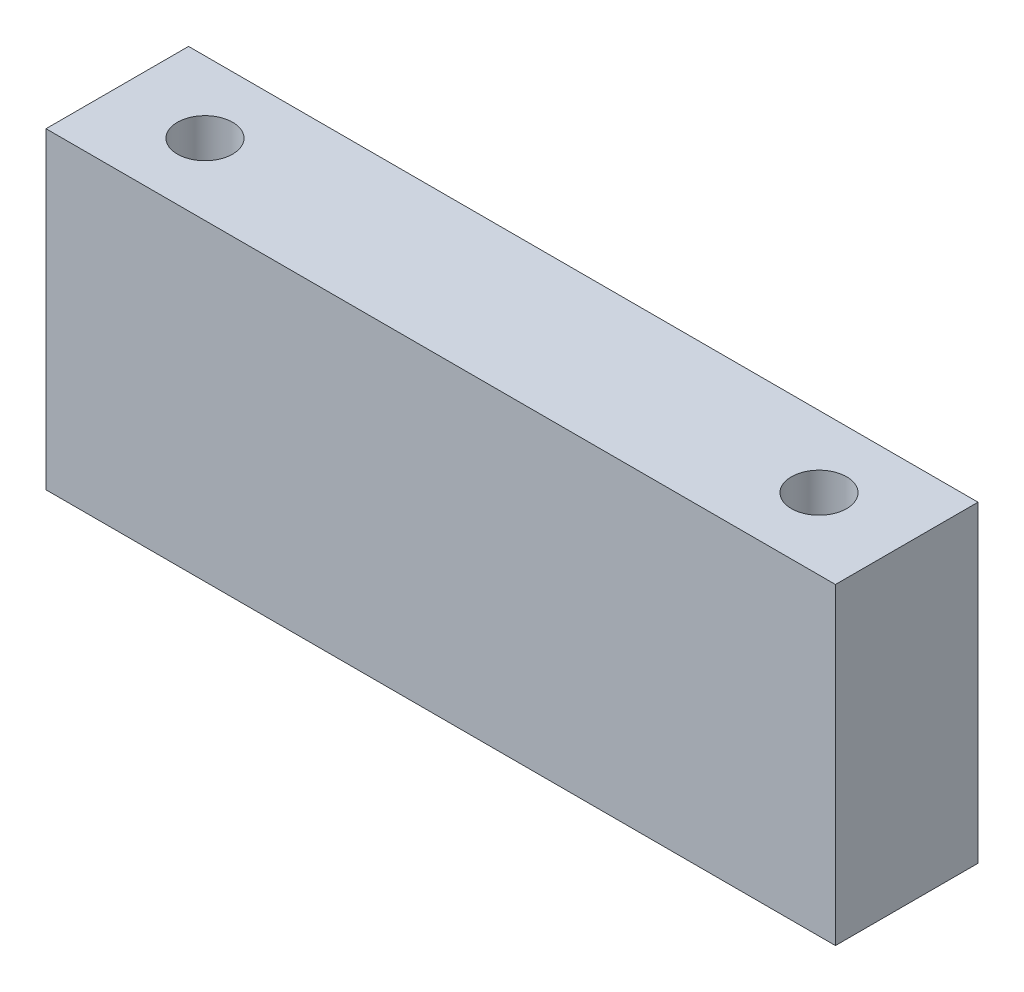
ISO-10303-21;
HEADER;
FILE_DESCRIPTION(('STEP AP214'),'2;1');
FILE_NAME('part.step','',(''),(''),'','','');
FILE_SCHEMA(('AUTOMOTIVE_DESIGN { 1 0 10303 214 1 1 1 1 }'));
ENDSEC;
DATA;
#1=APPLICATION_CONTEXT('core data for automotive mechanical design processes');
#2=APPLICATION_PROTOCOL_DEFINITION('international standard','automotive_design',2000,#1);
#3=PRODUCT_CONTEXT('',#1,'mechanical');
#4=PRODUCT('Part','Part','',(#3));
#5=PRODUCT_RELATED_PRODUCT_CATEGORY('part','',(#4));
#6=PRODUCT_DEFINITION_FORMATION('','',#4);
#7=PRODUCT_DEFINITION_CONTEXT('part definition',#1,'design');
#8=PRODUCT_DEFINITION('design','',#6,#7);
#9=PRODUCT_DEFINITION_SHAPE('','',#8);
#10=(LENGTH_UNIT() NAMED_UNIT(*) SI_UNIT(.MILLI.,.METRE.));
#11=(NAMED_UNIT(*) PLANE_ANGLE_UNIT() SI_UNIT($,.RADIAN.));
#12=(NAMED_UNIT(*) SI_UNIT($,.STERADIAN.) SOLID_ANGLE_UNIT());
#13=UNCERTAINTY_MEASURE_WITH_UNIT(LENGTH_MEASURE(1.E-05),#10,'distance_accuracy_value','');
#14=(GEOMETRIC_REPRESENTATION_CONTEXT(3) GLOBAL_UNCERTAINTY_ASSIGNED_CONTEXT((#13)) GLOBAL_UNIT_ASSIGNED_CONTEXT((#10,
#11,#12)) REPRESENTATION_CONTEXT('',''));
#15=CARTESIAN_POINT('',(0.,0.,0.));
#16=DIRECTION('',(0.,0.,1.));
#17=DIRECTION('',(1.,0.,0.));
#18=AXIS2_PLACEMENT_3D('',#15,#16,#17);
#19=CARTESIAN_POINT('',(0.,22.64,0.));
#20=DIRECTION('',(0.,-1.,0.));
#21=DIRECTION('',(0.,0.,-1.));
#22=AXIS2_PLACEMENT_3D('',#19,#20,#21);
#23=PLANE('',#22);
#24=DIRECTION('',(0.,0.,-1.));
#25=VECTOR('',#24,1.);
#26=CARTESIAN_POINT('',(28.575,22.64,5.16));
#27=LINE('',#26,#25);
#28=CARTESIAN_POINT('',(28.575,22.64,5.16));
#29=VERTEX_POINT('',#28);
#30=CARTESIAN_POINT('',(28.575,22.64,-5.16));
#31=VERTEX_POINT('',#30);
#32=EDGE_CURVE('E84',#29,#31,#27,.T.);
#33=ORIENTED_EDGE('',*,*,#32,.T.);
#34=DIRECTION('',(-1.,0.,0.));
#35=VECTOR('',#34,1.);
#36=CARTESIAN_POINT('',(-28.575,22.64,-5.16));
#37=LINE('',#36,#35);
#38=CARTESIAN_POINT('',(-28.575,22.64,-5.16));
#39=VERTEX_POINT('',#38);
#40=EDGE_CURVE('E79',#31,#39,#37,.T.);
#41=ORIENTED_EDGE('',*,*,#40,.T.);
#42=DIRECTION('',(0.,0.,1.));
#43=VECTOR('',#42,1.);
#44=CARTESIAN_POINT('',(-28.575,22.64,5.16));
#45=LINE('',#44,#43);
#46=CARTESIAN_POINT('',(-28.575,22.64,5.16));
#47=VERTEX_POINT('',#46);
#48=EDGE_CURVE('E82',#39,#47,#45,.T.);
#49=ORIENTED_EDGE('',*,*,#48,.T.);
#50=DIRECTION('',(1.,0.,0.));
#51=VECTOR('',#50,1.);
#52=CARTESIAN_POINT('',(-28.575,22.64,5.16));
#53=LINE('',#52,#51);
#54=EDGE_CURVE('E49',#47,#29,#53,.T.);
#55=ORIENTED_EDGE('',*,*,#54,.T.);
#56=EDGE_LOOP('',(#33,#41,#49,#55));
#57=FACE_BOUND('',#56,.T.);
#58=CARTESIAN_POINT('',(-22.225,22.64,0.));
#59=DIRECTION('',(0.,1.,0.));
#60=DIRECTION('',(0.,0.,1.));
#61=AXIS2_PLACEMENT_3D('',#58,#59,#60);
#62=CIRCLE('',#61,2.);
#63=CARTESIAN_POINT('',(-22.225,22.64,2.));
#64=VERTEX_POINT('',#63);
#65=EDGE_CURVE('E99',#64,#64,#62,.T.);
#66=ORIENTED_EDGE('',*,*,#65,.F.);
#67=EDGE_LOOP('',(#66));
#68=FACE_BOUND('',#67,.T.);
#69=CARTESIAN_POINT('',(22.225,22.64,0.));
#70=DIRECTION('',(0.,1.,0.));
#71=DIRECTION('',(0.,0.,1.));
#72=AXIS2_PLACEMENT_3D('',#69,#70,#71);
#73=CIRCLE('',#72,2.);
#74=CARTESIAN_POINT('',(22.225,22.64,2.));
#75=VERTEX_POINT('',#74);
#76=EDGE_CURVE('E114',#75,#75,#73,.T.);
#77=ORIENTED_EDGE('',*,*,#76,.F.);
#78=EDGE_LOOP('',(#77));
#79=FACE_BOUND('',#78,.T.);
#80=ADVANCED_FACE('F32',(#57,#68,#79),#23,.F.);
#81=CARTESIAN_POINT('',(0.,0.,0.));
#82=DIRECTION('',(0.,-1.,0.));
#83=DIRECTION('',(0.,0.,-1.));
#84=AXIS2_PLACEMENT_3D('',#81,#82,#83);
#85=PLANE('',#84);
#86=CARTESIAN_POINT('',(-22.225,0.,0.));
#87=DIRECTION('',(0.,1.,0.));
#88=DIRECTION('',(0.,0.,1.));
#89=AXIS2_PLACEMENT_3D('',#86,#87,#88);
#90=CIRCLE('',#89,2.);
#91=CARTESIAN_POINT('',(-22.225,0.,2.));
#92=VERTEX_POINT('',#91);
#93=EDGE_CURVE('E111',#92,#92,#90,.T.);
#94=ORIENTED_EDGE('',*,*,#93,.T.);
#95=EDGE_LOOP('',(#94));
#96=FACE_BOUND('',#95,.T.);
#97=DIRECTION('',(0.,0.,-1.));
#98=VECTOR('',#97,1.);
#99=CARTESIAN_POINT('',(28.575,0.,5.16));
#100=LINE('',#99,#98);
#101=CARTESIAN_POINT('',(28.575,0.,5.16));
#102=VERTEX_POINT('',#101);
#103=CARTESIAN_POINT('',(28.575,0.,-5.16));
#104=VERTEX_POINT('',#103);
#105=EDGE_CURVE('E96',#102,#104,#100,.T.);
#106=ORIENTED_EDGE('',*,*,#105,.F.);
#107=DIRECTION('',(1.,0.,0.));
#108=VECTOR('',#107,1.);
#109=CARTESIAN_POINT('',(-28.575,0.,5.16));
#110=LINE('',#109,#108);
#111=CARTESIAN_POINT('',(-28.575,0.,5.16));
#112=VERTEX_POINT('',#111);
#113=EDGE_CURVE('E72',#112,#102,#110,.T.);
#114=ORIENTED_EDGE('',*,*,#113,.F.);
#115=DIRECTION('',(0.,0.,1.));
#116=VECTOR('',#115,1.);
#117=CARTESIAN_POINT('',(-28.575,0.,5.16));
#118=LINE('',#117,#116);
#119=CARTESIAN_POINT('',(-28.575,0.,-5.16));
#120=VERTEX_POINT('',#119);
#121=EDGE_CURVE('E66',#120,#112,#118,.T.);
#122=ORIENTED_EDGE('',*,*,#121,.F.);
#123=DIRECTION('',(-1.,0.,0.));
#124=VECTOR('',#123,1.);
#125=CARTESIAN_POINT('',(-28.575,0.,-5.16));
#126=LINE('',#125,#124);
#127=EDGE_CURVE('E88',#104,#120,#126,.T.);
#128=ORIENTED_EDGE('',*,*,#127,.F.);
#129=EDGE_LOOP('',(#106,#114,#122,#128));
#130=FACE_BOUND('',#129,.T.);
#131=CARTESIAN_POINT('',(22.225,0.,0.));
#132=DIRECTION('',(0.,1.,0.));
#133=DIRECTION('',(0.,0.,1.));
#134=AXIS2_PLACEMENT_3D('',#131,#132,#133);
#135=CIRCLE('',#134,2.);
#136=CARTESIAN_POINT('',(22.225,0.,2.));
#137=VERTEX_POINT('',#136);
#138=EDGE_CURVE('E117',#137,#137,#135,.T.);
#139=ORIENTED_EDGE('',*,*,#138,.T.);
#140=EDGE_LOOP('',(#139));
#141=FACE_BOUND('',#140,.T.);
#142=ADVANCED_FACE('F107',(#96,#130,#141),#85,.T.);
#143=CARTESIAN_POINT('',(28.575,22.64,5.16));
#144=DIRECTION('',(-1.,0.,0.));
#145=DIRECTION('',(0.,0.,1.));
#146=AXIS2_PLACEMENT_3D('',#143,#144,#145);
#147=PLANE('',#146);
#148=ORIENTED_EDGE('',*,*,#105,.T.);
#149=DIRECTION('',(0.,-1.,0.));
#150=VECTOR('',#149,1.);
#151=CARTESIAN_POINT('',(28.575,22.64,-5.16));
#152=LINE('',#151,#150);
#153=EDGE_CURVE('E11',#31,#104,#152,.T.);
#154=ORIENTED_EDGE('',*,*,#153,.F.);
#155=ORIENTED_EDGE('',*,*,#32,.F.);
#156=DIRECTION('',(0.,-1.,0.));
#157=VECTOR('',#156,1.);
#158=CARTESIAN_POINT('',(28.575,22.64,5.16));
#159=LINE('',#158,#157);
#160=EDGE_CURVE('E92',#29,#102,#159,.T.);
#161=ORIENTED_EDGE('',*,*,#160,.T.);
#162=EDGE_LOOP('',(#148,#154,#155,#161));
#163=FACE_BOUND('',#162,.T.);
#164=ADVANCED_FACE('F34',(#163),#147,.F.);
#165=CARTESIAN_POINT('',(-28.575,22.64,-5.16));
#166=DIRECTION('',(0.,0.,1.));
#167=DIRECTION('',(1.,0.,0.));
#168=AXIS2_PLACEMENT_3D('',#165,#166,#167);
#169=PLANE('',#168);
#170=ORIENTED_EDGE('',*,*,#127,.T.);
#171=DIRECTION('',(0.,-1.,0.));
#172=VECTOR('',#171,1.);
#173=CARTESIAN_POINT('',(-28.575,22.64,-5.16));
#174=LINE('',#173,#172);
#175=EDGE_CURVE('E41',#39,#120,#174,.T.);
#176=ORIENTED_EDGE('',*,*,#175,.F.);
#177=ORIENTED_EDGE('',*,*,#40,.F.);
#178=ORIENTED_EDGE('',*,*,#153,.T.);
#179=EDGE_LOOP('',(#170,#176,#177,#178));
#180=FACE_BOUND('',#179,.T.);
#181=ADVANCED_FACE('F87',(#180),#169,.F.);
#182=CARTESIAN_POINT('',(-28.575,22.64,5.16));
#183=DIRECTION('',(1.,0.,0.));
#184=DIRECTION('',(0.,0.,-1.));
#185=AXIS2_PLACEMENT_3D('',#182,#183,#184);
#186=PLANE('',#185);
#187=ORIENTED_EDGE('',*,*,#121,.T.);
#188=DIRECTION('',(0.,-1.,0.));
#189=VECTOR('',#188,1.);
#190=CARTESIAN_POINT('',(-28.575,22.64,5.16));
#191=LINE('',#190,#189);
#192=EDGE_CURVE('E89',#47,#112,#191,.T.);
#193=ORIENTED_EDGE('',*,*,#192,.F.);
#194=ORIENTED_EDGE('',*,*,#48,.F.);
#195=ORIENTED_EDGE('',*,*,#175,.T.);
#196=EDGE_LOOP('',(#187,#193,#194,#195));
#197=FACE_BOUND('',#196,.T.);
#198=ADVANCED_FACE('F90',(#197),#186,.F.);
#199=CARTESIAN_POINT('',(-28.575,22.64,5.16));
#200=DIRECTION('',(0.,0.,-1.));
#201=DIRECTION('',(-1.,0.,0.));
#202=AXIS2_PLACEMENT_3D('',#199,#200,#201);
#203=PLANE('',#202);
#204=ORIENTED_EDGE('',*,*,#113,.T.);
#205=ORIENTED_EDGE('',*,*,#160,.F.);
#206=ORIENTED_EDGE('',*,*,#54,.F.);
#207=ORIENTED_EDGE('',*,*,#192,.T.);
#208=EDGE_LOOP('',(#204,#205,#206,#207));
#209=FACE_BOUND('',#208,.T.);
#210=ADVANCED_FACE('F104',(#209),#203,.F.);
#211=CARTESIAN_POINT('',(-22.225,22.64,0.));
#212=DIRECTION('',(0.,-1.,0.));
#213=DIRECTION('',(0.,0.,-1.));
#214=AXIS2_PLACEMENT_3D('',#211,#212,#213);
#215=CYLINDRICAL_SURFACE('',#214,2.);
#216=ORIENTED_EDGE('',*,*,#65,.T.);
#217=EDGE_LOOP('',(#216));
#218=FACE_BOUND('',#217,.T.);
#219=ORIENTED_EDGE('',*,*,#93,.F.);
#220=EDGE_LOOP('',(#219));
#221=FACE_BOUND('',#220,.T.);
#222=ADVANCED_FACE('F134',(#218,#221),#215,.F.);
#223=CARTESIAN_POINT('',(22.225,22.64,0.));
#224=DIRECTION('',(0.,-1.,0.));
#225=DIRECTION('',(0.,0.,-1.));
#226=AXIS2_PLACEMENT_3D('',#223,#224,#225);
#227=CYLINDRICAL_SURFACE('',#226,2.);
#228=ORIENTED_EDGE('',*,*,#76,.T.);
#229=EDGE_LOOP('',(#228));
#230=FACE_BOUND('',#229,.T.);
#231=ORIENTED_EDGE('',*,*,#138,.F.);
#232=EDGE_LOOP('',(#231));
#233=FACE_BOUND('',#232,.T.);
#234=ADVANCED_FACE('F123',(#230,#233),#227,.F.);
#235=CLOSED_SHELL('',(#80,#142,#164,#181,#198,#210,#222,#234));
#236=MANIFOLD_SOLID_BREP('B2',#235);
#237=ADVANCED_BREP_SHAPE_REPRESENTATION('',(#18,#236),#14);
#238=SHAPE_DEFINITION_REPRESENTATION(#9,#237);
ENDSEC;
END-ISO-10303-21;
